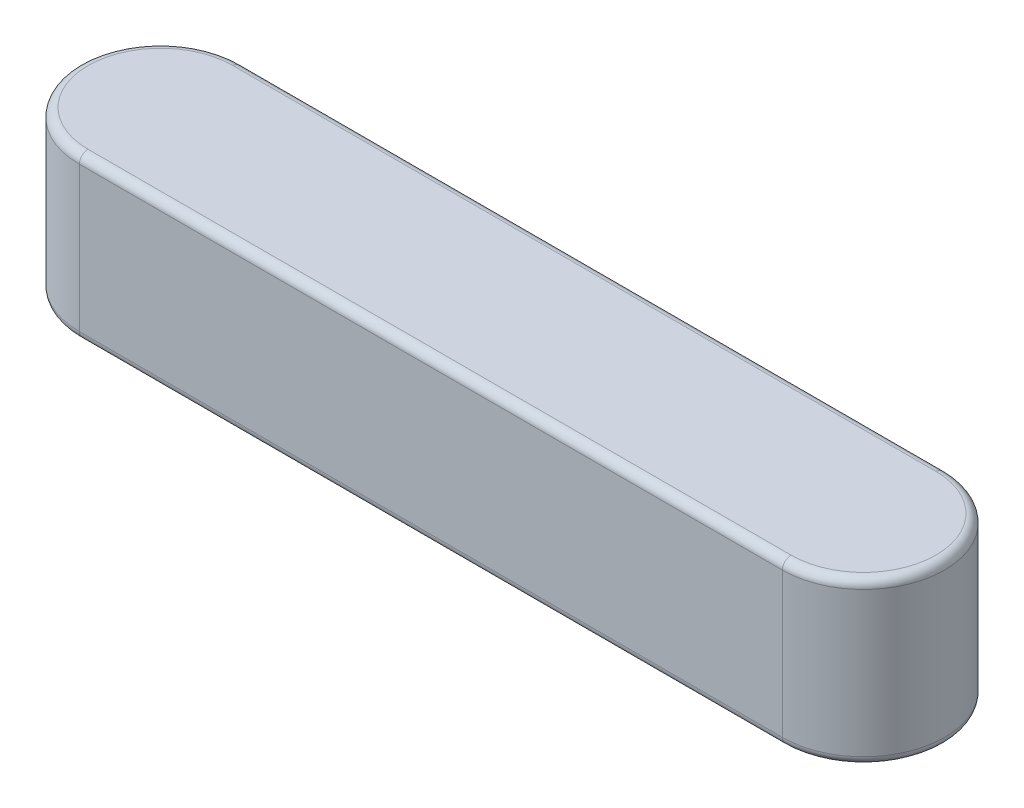
ISO-10303-21;
HEADER;
FILE_DESCRIPTION(('STEP AP214'),'2;1');
FILE_NAME('part.step','',(''),(''),'','','');
FILE_SCHEMA(('AUTOMOTIVE_DESIGN { 1 0 10303 214 1 1 1 1 }'));
ENDSEC;
DATA;
#1=APPLICATION_CONTEXT('core data for automotive mechanical design processes');
#2=APPLICATION_PROTOCOL_DEFINITION('international standard','automotive_design',2000,#1);
#3=PRODUCT_CONTEXT('',#1,'mechanical');
#4=PRODUCT('Part','Part','',(#3));
#5=PRODUCT_RELATED_PRODUCT_CATEGORY('part','',(#4));
#6=PRODUCT_DEFINITION_FORMATION('','',#4);
#7=PRODUCT_DEFINITION_CONTEXT('part definition',#1,'design');
#8=PRODUCT_DEFINITION('design','',#6,#7);
#9=PRODUCT_DEFINITION_SHAPE('','',#8);
#10=(LENGTH_UNIT() NAMED_UNIT(*) SI_UNIT(.MILLI.,.METRE.));
#11=(NAMED_UNIT(*) PLANE_ANGLE_UNIT() SI_UNIT($,.RADIAN.));
#12=(NAMED_UNIT(*) SI_UNIT($,.STERADIAN.) SOLID_ANGLE_UNIT());
#13=UNCERTAINTY_MEASURE_WITH_UNIT(LENGTH_MEASURE(1.E-05),#10,'distance_accuracy_value','');
#14=(GEOMETRIC_REPRESENTATION_CONTEXT(3) GLOBAL_UNCERTAINTY_ASSIGNED_CONTEXT((#13)) GLOBAL_UNIT_ASSIGNED_CONTEXT((#10,
#11,#12)) REPRESENTATION_CONTEXT('',''));
#15=CARTESIAN_POINT('',(0.,0.,0.));
#16=DIRECTION('',(0.,0.,1.));
#17=DIRECTION('',(1.,0.,0.));
#18=AXIS2_PLACEMENT_3D('',#15,#16,#17);
#19=CARTESIAN_POINT('',(-13.,3.,0.));
#20=DIRECTION('',(0.,-1.,0.));
#21=DIRECTION('',(0.,0.,-1.));
#22=AXIS2_PLACEMENT_3D('',#19,#20,#21);
#23=CYLINDRICAL_SURFACE('',#22,1.5);
#24=DIRECTION('',(0.,-1.,0.));
#25=VECTOR('',#24,1.);
#26=CARTESIAN_POINT('',(-13.,3.,-1.5));
#27=LINE('',#26,#25);
#28=CARTESIAN_POINT('',(-13.,2.84,-1.5));
#29=VERTEX_POINT('',#28);
#30=CARTESIAN_POINT('',(-13.,0.16,-1.5));
#31=VERTEX_POINT('',#30);
#32=EDGE_CURVE('E104',#29,#31,#27,.T.);
#33=ORIENTED_EDGE('',*,*,#32,.T.);
#34=CARTESIAN_POINT('',(-13.,0.16,0.));
#35=DIRECTION('',(0.,1.,0.));
#36=DIRECTION('',(0.,0.,1.));
#37=AXIS2_PLACEMENT_3D('',#34,#35,#36);
#38=CIRCLE('',#37,1.5);
#39=CARTESIAN_POINT('',(-13.,0.16,1.5));
#40=VERTEX_POINT('',#39);
#41=EDGE_CURVE('E111',#31,#40,#38,.T.);
#42=ORIENTED_EDGE('',*,*,#41,.T.);
#43=DIRECTION('',(0.,-1.,0.));
#44=VECTOR('',#43,1.);
#45=CARTESIAN_POINT('',(-13.,3.,1.5));
#46=LINE('',#45,#44);
#47=CARTESIAN_POINT('',(-13.,2.84,1.5));
#48=VERTEX_POINT('',#47);
#49=EDGE_CURVE('E106',#48,#40,#46,.T.);
#50=ORIENTED_EDGE('',*,*,#49,.F.);
#51=CARTESIAN_POINT('',(-13.,2.84,0.));
#52=DIRECTION('',(0.,1.,0.));
#53=DIRECTION('',(0.,0.,1.));
#54=AXIS2_PLACEMENT_3D('',#51,#52,#53);
#55=CIRCLE('',#54,1.5);
#56=EDGE_CURVE('E102',#48,#29,#55,.F.);
#57=ORIENTED_EDGE('',*,*,#56,.T.);
#58=EDGE_LOOP('',(#33,#42,#50,#57));
#59=FACE_BOUND('',#58,.T.);
#60=ADVANCED_FACE('F33',(#59),#23,.T.);
#61=CARTESIAN_POINT('',(-13.,3.,1.5));
#62=DIRECTION('',(0.,0.,-1.));
#63=DIRECTION('',(-1.,0.,0.));
#64=AXIS2_PLACEMENT_3D('',#61,#62,#63);
#65=PLANE('',#64);
#66=ORIENTED_EDGE('',*,*,#49,.T.);
#67=DIRECTION('',(1.,0.,0.));
#68=VECTOR('',#67,1.);
#69=CARTESIAN_POINT('',(-13.,0.16,1.5));
#70=LINE('',#69,#68);
#71=CARTESIAN_POINT('',(0.,0.16,1.5));
#72=VERTEX_POINT('',#71);
#73=EDGE_CURVE('E155',#40,#72,#70,.T.);
#74=ORIENTED_EDGE('',*,*,#73,.T.);
#75=DIRECTION('',(0.,-1.,0.));
#76=VECTOR('',#75,1.);
#77=CARTESIAN_POINT('',(0.,3.,1.5));
#78=LINE('',#77,#76);
#79=CARTESIAN_POINT('',(0.,2.84,1.5));
#80=VERTEX_POINT('',#79);
#81=EDGE_CURVE('E136',#80,#72,#78,.T.);
#82=ORIENTED_EDGE('',*,*,#81,.F.);
#83=DIRECTION('',(1.,0.,0.));
#84=VECTOR('',#83,1.);
#85=CARTESIAN_POINT('',(-13.,2.84,1.5));
#86=LINE('',#85,#84);
#87=EDGE_CURVE('E153',#80,#48,#86,.F.);
#88=ORIENTED_EDGE('',*,*,#87,.T.);
#89=EDGE_LOOP('',(#66,#74,#82,#88));
#90=FACE_BOUND('',#89,.T.);
#91=ADVANCED_FACE('F181',(#90),#65,.F.);
#92=CARTESIAN_POINT('',(0.,3.,0.));
#93=DIRECTION('',(0.,-1.,0.));
#94=DIRECTION('',(0.,0.,-1.));
#95=AXIS2_PLACEMENT_3D('',#92,#93,#94);
#96=CYLINDRICAL_SURFACE('',#95,1.5);
#97=ORIENTED_EDGE('',*,*,#81,.T.);
#98=CARTESIAN_POINT('',(0.,0.16,0.));
#99=DIRECTION('',(0.,1.,0.));
#100=DIRECTION('',(0.,0.,1.));
#101=AXIS2_PLACEMENT_3D('',#98,#99,#100);
#102=CIRCLE('',#101,1.5);
#103=CARTESIAN_POINT('',(0.,0.16,-1.5));
#104=VERTEX_POINT('',#103);
#105=EDGE_CURVE('E112',#72,#104,#102,.T.);
#106=ORIENTED_EDGE('',*,*,#105,.T.);
#107=DIRECTION('',(0.,-1.,0.));
#108=VECTOR('',#107,1.);
#109=CARTESIAN_POINT('',(0.,3.,-1.5));
#110=LINE('',#109,#108);
#111=CARTESIAN_POINT('',(0.,2.84,-1.5));
#112=VERTEX_POINT('',#111);
#113=EDGE_CURVE('E123',#112,#104,#110,.T.);
#114=ORIENTED_EDGE('',*,*,#113,.F.);
#115=CARTESIAN_POINT('',(0.,2.84,0.));
#116=DIRECTION('',(0.,1.,0.));
#117=DIRECTION('',(0.,0.,1.));
#118=AXIS2_PLACEMENT_3D('',#115,#116,#117);
#119=CIRCLE('',#118,1.5);
#120=EDGE_CURVE('E148',#112,#80,#119,.F.);
#121=ORIENTED_EDGE('',*,*,#120,.T.);
#122=EDGE_LOOP('',(#97,#106,#114,#121));
#123=FACE_BOUND('',#122,.T.);
#124=ADVANCED_FACE('F179',(#123),#96,.T.);
#125=CARTESIAN_POINT('',(-13.,3.,-1.5));
#126=DIRECTION('',(0.,0.,1.));
#127=DIRECTION('',(1.,0.,0.));
#128=AXIS2_PLACEMENT_3D('',#125,#126,#127);
#129=PLANE('',#128);
#130=ORIENTED_EDGE('',*,*,#113,.T.);
#131=DIRECTION('',(-1.,0.,0.));
#132=VECTOR('',#131,1.);
#133=CARTESIAN_POINT('',(-13.,0.16,-1.5));
#134=LINE('',#133,#132);
#135=EDGE_CURVE('E122',#104,#31,#134,.T.);
#136=ORIENTED_EDGE('',*,*,#135,.T.);
#137=ORIENTED_EDGE('',*,*,#32,.F.);
#138=DIRECTION('',(-1.,0.,0.));
#139=VECTOR('',#138,1.);
#140=CARTESIAN_POINT('',(0.,2.84,-1.5));
#141=LINE('',#140,#139);
#142=EDGE_CURVE('E119',#29,#112,#141,.F.);
#143=ORIENTED_EDGE('',*,*,#142,.T.);
#144=EDGE_LOOP('',(#130,#136,#137,#143));
#145=FACE_BOUND('',#144,.T.);
#146=ADVANCED_FACE('F117',(#145),#129,.F.);
#147=CARTESIAN_POINT('',(-13.,3.,0.));
#148=DIRECTION('',(0.,1.,0.));
#149=DIRECTION('',(0.,0.,1.));
#150=AXIS2_PLACEMENT_3D('',#147,#148,#149);
#151=PLANE('',#150);
#152=DIRECTION('',(1.,0.,0.));
#153=VECTOR('',#152,1.);
#154=CARTESIAN_POINT('',(0.,3.,1.34));
#155=LINE('',#154,#153);
#156=CARTESIAN_POINT('',(-13.,3.,1.34));
#157=VERTEX_POINT('',#156);
#158=CARTESIAN_POINT('',(0.,3.,1.34));
#159=VERTEX_POINT('',#158);
#160=EDGE_CURVE('E42',#157,#159,#155,.T.);
#161=ORIENTED_EDGE('',*,*,#160,.T.);
#162=CARTESIAN_POINT('',(0.,3.,0.));
#163=DIRECTION('',(0.,1.,0.));
#164=DIRECTION('',(0.,0.,1.));
#165=AXIS2_PLACEMENT_3D('',#162,#163,#164);
#166=CIRCLE('',#165,1.34);
#167=CARTESIAN_POINT('',(0.,3.,-1.34));
#168=VERTEX_POINT('',#167);
#169=EDGE_CURVE('E11',#159,#168,#166,.T.);
#170=ORIENTED_EDGE('',*,*,#169,.T.);
#171=DIRECTION('',(-1.,0.,0.));
#172=VECTOR('',#171,1.);
#173=CARTESIAN_POINT('',(-13.,3.,-1.34));
#174=LINE('',#173,#172);
#175=CARTESIAN_POINT('',(-13.,3.,-1.34));
#176=VERTEX_POINT('',#175);
#177=EDGE_CURVE('E158',#168,#176,#174,.T.);
#178=ORIENTED_EDGE('',*,*,#177,.T.);
#179=CARTESIAN_POINT('',(-13.,3.,0.));
#180=DIRECTION('',(0.,1.,0.));
#181=DIRECTION('',(0.,0.,1.));
#182=AXIS2_PLACEMENT_3D('',#179,#180,#181);
#183=CIRCLE('',#182,1.34);
#184=EDGE_CURVE('E129',#176,#157,#183,.T.);
#185=ORIENTED_EDGE('',*,*,#184,.T.);
#186=EDGE_LOOP('',(#161,#170,#178,#185));
#187=FACE_BOUND('',#186,.T.);
#188=ADVANCED_FACE('F204',(#187),#151,.T.);
#189=CARTESIAN_POINT('',(-13.,0.,0.));
#190=DIRECTION('',(0.,1.,0.));
#191=DIRECTION('',(0.,0.,1.));
#192=AXIS2_PLACEMENT_3D('',#189,#190,#191);
#193=PLANE('',#192);
#194=CARTESIAN_POINT('',(-13.,0.,0.));
#195=DIRECTION('',(0.,1.,0.));
#196=DIRECTION('',(0.,0.,1.));
#197=AXIS2_PLACEMENT_3D('',#194,#195,#196);
#198=CIRCLE('',#197,1.34);
#199=CARTESIAN_POINT('',(-13.,0.,1.34));
#200=VERTEX_POINT('',#199);
#201=CARTESIAN_POINT('',(-13.,0.,-1.34));
#202=VERTEX_POINT('',#201);
#203=EDGE_CURVE('E141',#200,#202,#198,.F.);
#204=ORIENTED_EDGE('',*,*,#203,.T.);
#205=DIRECTION('',(-1.,0.,0.));
#206=VECTOR('',#205,1.);
#207=CARTESIAN_POINT('',(-13.,0.,-1.34));
#208=LINE('',#207,#206);
#209=CARTESIAN_POINT('',(0.,0.,-1.34));
#210=VERTEX_POINT('',#209);
#211=EDGE_CURVE('E145',#202,#210,#208,.F.);
#212=ORIENTED_EDGE('',*,*,#211,.T.);
#213=CARTESIAN_POINT('',(0.,0.,0.));
#214=DIRECTION('',(0.,1.,0.));
#215=DIRECTION('',(0.,0.,1.));
#216=AXIS2_PLACEMENT_3D('',#213,#214,#215);
#217=CIRCLE('',#216,1.34);
#218=CARTESIAN_POINT('',(0.,0.,1.34));
#219=VERTEX_POINT('',#218);
#220=EDGE_CURVE('E143',#210,#219,#217,.F.);
#221=ORIENTED_EDGE('',*,*,#220,.T.);
#222=DIRECTION('',(1.,0.,0.));
#223=VECTOR('',#222,1.);
#224=CARTESIAN_POINT('',(-13.,0.,1.34));
#225=LINE('',#224,#223);
#226=EDGE_CURVE('E134',#219,#200,#225,.F.);
#227=ORIENTED_EDGE('',*,*,#226,.T.);
#228=EDGE_LOOP('',(#204,#212,#221,#227));
#229=FACE_BOUND('',#228,.T.);
#230=ADVANCED_FACE('F202',(#229),#193,.F.);
#231=CARTESIAN_POINT('',(-13.,0.16,1.34));
#232=DIRECTION('',(1.,0.,0.));
#233=DIRECTION('',(0.,0.,-1.));
#234=AXIS2_PLACEMENT_3D('',#231,#232,#233);
#235=CYLINDRICAL_SURFACE('',#234,0.16);
#236=CARTESIAN_POINT('',(-13.,0.16,1.34));
#237=DIRECTION('',(-1.,0.,0.));
#238=DIRECTION('',(0.,0.,1.));
#239=AXIS2_PLACEMENT_3D('',#236,#237,#238);
#240=CIRCLE('',#239,0.16);
#241=EDGE_CURVE('E165',#200,#40,#240,.T.);
#242=ORIENTED_EDGE('',*,*,#241,.F.);
#243=ORIENTED_EDGE('',*,*,#226,.F.);
#244=CARTESIAN_POINT('',(0.,0.16,1.34));
#245=DIRECTION('',(1.,0.,0.));
#246=DIRECTION('',(0.,0.,-1.));
#247=AXIS2_PLACEMENT_3D('',#244,#245,#246);
#248=CIRCLE('',#247,0.16);
#249=EDGE_CURVE('E124',#72,#219,#248,.T.);
#250=ORIENTED_EDGE('',*,*,#249,.F.);
#251=ORIENTED_EDGE('',*,*,#73,.F.);
#252=EDGE_LOOP('',(#242,#243,#250,#251));
#253=FACE_BOUND('',#252,.T.);
#254=ADVANCED_FACE('F199',(#253),#235,.T.);
#255=CARTESIAN_POINT('',(0.,0.16,0.));
#256=DIRECTION('',(0.,1.,0.));
#257=DIRECTION('',(0.,0.,1.));
#258=AXIS2_PLACEMENT_3D('',#255,#256,#257);
#259=TOROIDAL_SURFACE('',#258,1.34,0.16);
#260=ORIENTED_EDGE('',*,*,#249,.T.);
#261=ORIENTED_EDGE('',*,*,#220,.F.);
#262=CARTESIAN_POINT('',(0.,0.16,-1.34));
#263=DIRECTION('',(-1.,0.,0.));
#264=DIRECTION('',(0.,0.,1.));
#265=AXIS2_PLACEMENT_3D('',#262,#263,#264);
#266=CIRCLE('',#265,0.16);
#267=EDGE_CURVE('E163',#104,#210,#266,.T.);
#268=ORIENTED_EDGE('',*,*,#267,.F.);
#269=ORIENTED_EDGE('',*,*,#105,.F.);
#270=EDGE_LOOP('',(#260,#261,#268,#269));
#271=FACE_BOUND('',#270,.T.);
#272=ADVANCED_FACE('F188',(#271),#259,.T.);
#273=CARTESIAN_POINT('',(-13.,0.16,0.));
#274=DIRECTION('',(0.,1.,0.));
#275=DIRECTION('',(0.,0.,1.));
#276=AXIS2_PLACEMENT_3D('',#273,#274,#275);
#277=TOROIDAL_SURFACE('',#276,1.34,0.16);
#278=ORIENTED_EDGE('',*,*,#241,.T.);
#279=ORIENTED_EDGE('',*,*,#41,.F.);
#280=CARTESIAN_POINT('',(-13.,0.16,-1.34));
#281=DIRECTION('',(1.,0.,0.));
#282=DIRECTION('',(0.,0.,-1.));
#283=AXIS2_PLACEMENT_3D('',#280,#281,#282);
#284=CIRCLE('',#283,0.16);
#285=EDGE_CURVE('E161',#202,#31,#284,.T.);
#286=ORIENTED_EDGE('',*,*,#285,.F.);
#287=ORIENTED_EDGE('',*,*,#203,.F.);
#288=EDGE_LOOP('',(#278,#279,#286,#287));
#289=FACE_BOUND('',#288,.T.);
#290=ADVANCED_FACE('F196',(#289),#277,.T.);
#291=CARTESIAN_POINT('',(-13.,0.16,-1.34));
#292=DIRECTION('',(-1.,0.,0.));
#293=DIRECTION('',(0.,0.,1.));
#294=AXIS2_PLACEMENT_3D('',#291,#292,#293);
#295=CYLINDRICAL_SURFACE('',#294,0.16);
#296=ORIENTED_EDGE('',*,*,#267,.T.);
#297=ORIENTED_EDGE('',*,*,#211,.F.);
#298=ORIENTED_EDGE('',*,*,#285,.T.);
#299=ORIENTED_EDGE('',*,*,#135,.F.);
#300=EDGE_LOOP('',(#296,#297,#298,#299));
#301=FACE_BOUND('',#300,.T.);
#302=ADVANCED_FACE('F191',(#301),#295,.T.);
#303=CARTESIAN_POINT('',(-13.,2.84,0.));
#304=DIRECTION('',(0.,1.,0.));
#305=DIRECTION('',(0.,0.,1.));
#306=AXIS2_PLACEMENT_3D('',#303,#304,#305);
#307=TOROIDAL_SURFACE('',#306,1.34,0.16);
#308=CARTESIAN_POINT('',(-13.,2.84,-1.34));
#309=DIRECTION('',(1.,0.,0.));
#310=DIRECTION('',(0.,0.,-1.));
#311=AXIS2_PLACEMENT_3D('',#308,#309,#310);
#312=CIRCLE('',#311,0.16);
#313=EDGE_CURVE('E128',#29,#176,#312,.T.);
#314=ORIENTED_EDGE('',*,*,#313,.F.);
#315=ORIENTED_EDGE('',*,*,#56,.F.);
#316=CARTESIAN_POINT('',(-13.,2.84,1.34));
#317=DIRECTION('',(1.,0.,0.));
#318=DIRECTION('',(0.,0.,-1.));
#319=AXIS2_PLACEMENT_3D('',#316,#317,#318);
#320=CIRCLE('',#319,0.16);
#321=EDGE_CURVE('E37',#157,#48,#320,.T.);
#322=ORIENTED_EDGE('',*,*,#321,.F.);
#323=ORIENTED_EDGE('',*,*,#184,.F.);
#324=EDGE_LOOP('',(#314,#315,#322,#323));
#325=FACE_BOUND('',#324,.T.);
#326=ADVANCED_FACE('F35',(#325),#307,.T.);
#327=CARTESIAN_POINT('',(-13.,2.84,1.34));
#328=DIRECTION('',(-1.,0.,0.));
#329=DIRECTION('',(0.,0.,1.));
#330=AXIS2_PLACEMENT_3D('',#327,#328,#329);
#331=CYLINDRICAL_SURFACE('',#330,0.16);
#332=ORIENTED_EDGE('',*,*,#321,.T.);
#333=ORIENTED_EDGE('',*,*,#87,.F.);
#334=CARTESIAN_POINT('',(0.,2.84,1.34));
#335=DIRECTION('',(1.,0.,0.));
#336=DIRECTION('',(0.,0.,-1.));
#337=AXIS2_PLACEMENT_3D('',#334,#335,#336);
#338=CIRCLE('',#337,0.16);
#339=EDGE_CURVE('E131',#159,#80,#338,.T.);
#340=ORIENTED_EDGE('',*,*,#339,.F.);
#341=ORIENTED_EDGE('',*,*,#160,.F.);
#342=EDGE_LOOP('',(#332,#333,#340,#341));
#343=FACE_BOUND('',#342,.T.);
#344=ADVANCED_FACE('F174',(#343),#331,.T.);
#345=CARTESIAN_POINT('',(-13.,2.84,-1.34));
#346=DIRECTION('',(1.,0.,0.));
#347=DIRECTION('',(0.,0.,-1.));
#348=AXIS2_PLACEMENT_3D('',#345,#346,#347);
#349=CYLINDRICAL_SURFACE('',#348,0.16);
#350=ORIENTED_EDGE('',*,*,#313,.T.);
#351=ORIENTED_EDGE('',*,*,#177,.F.);
#352=CARTESIAN_POINT('',(0.,2.84,-1.34));
#353=DIRECTION('',(1.,0.,0.));
#354=DIRECTION('',(0.,0.,-1.));
#355=AXIS2_PLACEMENT_3D('',#352,#353,#354);
#356=CIRCLE('',#355,0.16);
#357=EDGE_CURVE('E56',#112,#168,#356,.T.);
#358=ORIENTED_EDGE('',*,*,#357,.F.);
#359=ORIENTED_EDGE('',*,*,#142,.F.);
#360=EDGE_LOOP('',(#350,#351,#358,#359));
#361=FACE_BOUND('',#360,.T.);
#362=ADVANCED_FACE('F132',(#361),#349,.T.);
#363=CARTESIAN_POINT('',(0.,2.84,0.));
#364=DIRECTION('',(0.,1.,0.));
#365=DIRECTION('',(0.,0.,1.));
#366=AXIS2_PLACEMENT_3D('',#363,#364,#365);
#367=TOROIDAL_SURFACE('',#366,1.34,0.16);
#368=ORIENTED_EDGE('',*,*,#339,.T.);
#369=ORIENTED_EDGE('',*,*,#120,.F.);
#370=ORIENTED_EDGE('',*,*,#357,.T.);
#371=ORIENTED_EDGE('',*,*,#169,.F.);
#372=EDGE_LOOP('',(#368,#369,#370,#371));
#373=FACE_BOUND('',#372,.T.);
#374=ADVANCED_FACE('F172',(#373),#367,.T.);
#375=CLOSED_SHELL('',(#60,#91,#124,#146,#188,#230,#254,#272,#290,#302,#326,#344,#362,#374));
#376=MANIFOLD_SOLID_BREP('B2',#375);
#377=ADVANCED_BREP_SHAPE_REPRESENTATION('',(#18,#376),#14);
#378=SHAPE_DEFINITION_REPRESENTATION(#9,#377);
ENDSEC;
END-ISO-10303-21;
